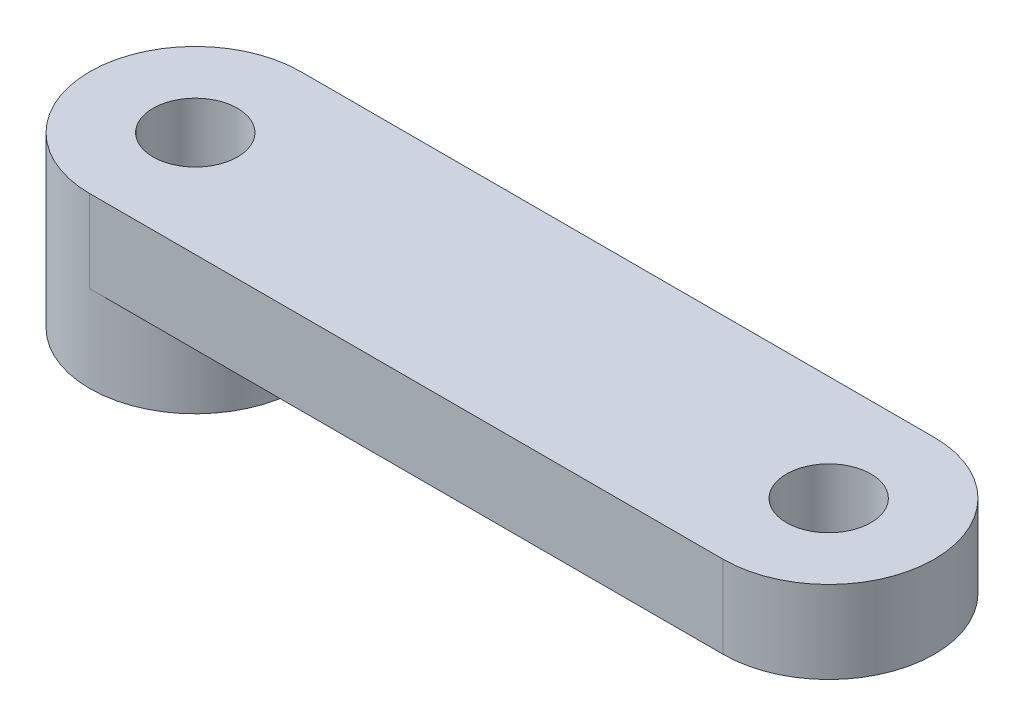
ISO-10303-21;
HEADER;
FILE_DESCRIPTION(('STEP AP214'),'2;1');
FILE_NAME('part.step','',(''),(''),'','','');
FILE_SCHEMA(('AUTOMOTIVE_DESIGN { 1 0 10303 214 1 1 1 1 }'));
ENDSEC;
DATA;
#1=APPLICATION_CONTEXT('core data for automotive mechanical design processes');
#2=APPLICATION_PROTOCOL_DEFINITION('international standard','automotive_design',2000,#1);
#3=PRODUCT_CONTEXT('',#1,'mechanical');
#4=PRODUCT('Part','Part','',(#3));
#5=PRODUCT_RELATED_PRODUCT_CATEGORY('part','',(#4));
#6=PRODUCT_DEFINITION_FORMATION('','',#4);
#7=PRODUCT_DEFINITION_CONTEXT('part definition',#1,'design');
#8=PRODUCT_DEFINITION('design','',#6,#7);
#9=PRODUCT_DEFINITION_SHAPE('','',#8);
#10=(LENGTH_UNIT() NAMED_UNIT(*) SI_UNIT(.MILLI.,.METRE.));
#11=(NAMED_UNIT(*) PLANE_ANGLE_UNIT() SI_UNIT($,.RADIAN.));
#12=(NAMED_UNIT(*) SI_UNIT($,.STERADIAN.) SOLID_ANGLE_UNIT());
#13=UNCERTAINTY_MEASURE_WITH_UNIT(LENGTH_MEASURE(1.E-05),#10,'distance_accuracy_value','');
#14=(GEOMETRIC_REPRESENTATION_CONTEXT(3) GLOBAL_UNCERTAINTY_ASSIGNED_CONTEXT((#13)) GLOBAL_UNIT_ASSIGNED_CONTEXT((#10,
#11,#12)) REPRESENTATION_CONTEXT('',''));
#15=CARTESIAN_POINT('',(0.,0.,0.));
#16=DIRECTION('',(0.,0.,1.));
#17=DIRECTION('',(1.,0.,0.));
#18=AXIS2_PLACEMENT_3D('',#15,#16,#17);
#19=CARTESIAN_POINT('',(-10.3744813820519,-3.9,37.1786968159599));
#20=DIRECTION('',(0.,-1.,0.));
#21=DIRECTION('',(0.,0.,-1.));
#22=AXIS2_PLACEMENT_3D('',#19,#20,#21);
#23=PLANE('',#22);
#24=CARTESIAN_POINT('',(19.6255186179481,-3.9,37.1786968159599));
#25=DIRECTION('',(0.,-1.,0.));
#26=DIRECTION('',(0.,0.,-1.));
#27=AXIS2_PLACEMENT_3D('',#24,#25,#26);
#28=CIRCLE('',#27,2.);
#29=CARTESIAN_POINT('',(19.6255186179481,-3.9,35.1786968159599));
#30=VERTEX_POINT('',#29);
#31=EDGE_CURVE('E150',#30,#30,#28,.T.);
#32=ORIENTED_EDGE('',*,*,#31,.F.);
#33=EDGE_LOOP('',(#32));
#34=FACE_BOUND('',#33,.T.);
#35=DIRECTION('',(-1.,0.,0.));
#36=VECTOR('',#35,1.);
#37=CARTESIAN_POINT('',(19.6255186179481,-3.9,42.1786968159599));
#38=LINE('',#37,#36);
#39=CARTESIAN_POINT('',(19.6255186179481,-3.9,42.1786968159599));
#40=VERTEX_POINT('',#39);
#41=CARTESIAN_POINT('',(-10.3744813820519,-3.9,42.1786968159599));
#42=VERTEX_POINT('',#41);
#43=EDGE_CURVE('E34',#40,#42,#38,.T.);
#44=ORIENTED_EDGE('',*,*,#43,.T.);
#45=CARTESIAN_POINT('',(-10.3744813820519,-3.9,37.1786968159599));
#46=DIRECTION('',(0.,1.,0.));
#47=DIRECTION('',(-1.,0.,0.));
#48=AXIS2_PLACEMENT_3D('',#45,#46,#47);
#49=CIRCLE('',#48,5.);
#50=CARTESIAN_POINT('',(-10.3744813820519,-3.9,32.1786968159599));
#51=VERTEX_POINT('',#50);
#52=EDGE_CURVE('E68',#42,#51,#49,.T.);
#53=ORIENTED_EDGE('',*,*,#52,.T.);
#54=DIRECTION('',(1.,0.,0.));
#55=VECTOR('',#54,1.);
#56=CARTESIAN_POINT('',(-10.3744813820519,-3.9,32.1786968159599));
#57=LINE('',#56,#55);
#58=CARTESIAN_POINT('',(19.6255186179481,-3.9,32.1786968159599));
#59=VERTEX_POINT('',#58);
#60=EDGE_CURVE('E60',#51,#59,#57,.T.);
#61=ORIENTED_EDGE('',*,*,#60,.T.);
#62=CARTESIAN_POINT('',(19.6255186179481,-3.9,37.1786968159599));
#63=DIRECTION('',(0.,-1.,0.));
#64=DIRECTION('',(-1.,0.,0.));
#65=AXIS2_PLACEMENT_3D('',#62,#63,#64);
#66=CIRCLE('',#65,5.);
#67=EDGE_CURVE('E75',#59,#40,#66,.T.);
#68=ORIENTED_EDGE('',*,*,#67,.T.);
#69=EDGE_LOOP('',(#44,#53,#61,#68));
#70=FACE_BOUND('',#69,.T.);
#71=ADVANCED_FACE('F15',(#34,#70),#23,.T.);
#72=CARTESIAN_POINT('',(-10.3744813820519,-3.9,32.1786968159599));
#73=DIRECTION('',(0.,0.,1.));
#74=DIRECTION('',(1.,0.,0.));
#75=AXIS2_PLACEMENT_3D('',#72,#73,#74);
#76=PLANE('',#75);
#77=DIRECTION('',(1.,0.,0.));
#78=VECTOR('',#77,1.);
#79=CARTESIAN_POINT('',(-10.3744813820519,0.,32.1786968159599));
#80=LINE('',#79,#78);
#81=CARTESIAN_POINT('',(-10.3744813820519,0.,32.1786968159599));
#82=VERTEX_POINT('',#81);
#83=CARTESIAN_POINT('',(19.6255186179481,0.,32.1786968159599));
#84=VERTEX_POINT('',#83);
#85=EDGE_CURVE('E84',#82,#84,#80,.T.);
#86=ORIENTED_EDGE('',*,*,#85,.T.);
#87=DIRECTION('',(0.,1.,0.));
#88=VECTOR('',#87,1.);
#89=CARTESIAN_POINT('',(19.6255186179481,-3.9,32.1786968159599));
#90=LINE('',#89,#88);
#91=EDGE_CURVE('E25',#59,#84,#90,.T.);
#92=ORIENTED_EDGE('',*,*,#91,.F.);
#93=ORIENTED_EDGE('',*,*,#60,.F.);
#94=DIRECTION('',(0.,1.,0.));
#95=VECTOR('',#94,1.);
#96=CARTESIAN_POINT('',(-10.3744813820519,-3.9,32.1786968159599));
#97=LINE('',#96,#95);
#98=EDGE_CURVE('E9',#51,#82,#97,.T.);
#99=ORIENTED_EDGE('',*,*,#98,.T.);
#100=EDGE_LOOP('',(#86,#92,#93,#99));
#101=FACE_BOUND('',#100,.T.);
#102=ADVANCED_FACE('F17',(#101),#76,.F.);
#103=CARTESIAN_POINT('',(19.6255186179481,-3.9,37.1786968159599));
#104=DIRECTION('',(0.,1.,0.));
#105=DIRECTION('',(0.,0.,1.));
#106=AXIS2_PLACEMENT_3D('',#103,#104,#105);
#107=CYLINDRICAL_SURFACE('',#106,5.);
#108=CARTESIAN_POINT('',(19.6255186179481,0.,37.1786968159599));
#109=DIRECTION('',(0.,-1.,0.));
#110=DIRECTION('',(-1.,0.,0.));
#111=AXIS2_PLACEMENT_3D('',#108,#109,#110);
#112=CIRCLE('',#111,5.);
#113=CARTESIAN_POINT('',(19.6255186179481,0.,42.1786968159599));
#114=VERTEX_POINT('',#113);
#115=EDGE_CURVE('E51',#84,#114,#112,.T.);
#116=ORIENTED_EDGE('',*,*,#115,.T.);
#117=DIRECTION('',(0.,1.,0.));
#118=VECTOR('',#117,1.);
#119=CARTESIAN_POINT('',(19.6255186179481,-3.9,42.1786968159599));
#120=LINE('',#119,#118);
#121=EDGE_CURVE('E104',#40,#114,#120,.T.);
#122=ORIENTED_EDGE('',*,*,#121,.F.);
#123=ORIENTED_EDGE('',*,*,#67,.F.);
#124=ORIENTED_EDGE('',*,*,#91,.T.);
#125=EDGE_LOOP('',(#116,#122,#123,#124));
#126=FACE_BOUND('',#125,.T.);
#127=ADVANCED_FACE('F114',(#126),#107,.T.);
#128=CARTESIAN_POINT('',(19.6255186179481,-3.9,42.1786968159599));
#129=DIRECTION('',(0.,0.,-1.));
#130=DIRECTION('',(-1.,0.,0.));
#131=AXIS2_PLACEMENT_3D('',#128,#129,#130);
#132=PLANE('',#131);
#133=DIRECTION('',(-1.,0.,0.));
#134=VECTOR('',#133,1.);
#135=CARTESIAN_POINT('',(19.6255186179481,0.,42.1786968159599));
#136=LINE('',#135,#134);
#137=CARTESIAN_POINT('',(-10.3744813820519,0.,42.1786968159599));
#138=VERTEX_POINT('',#137);
#139=EDGE_CURVE('E56',#114,#138,#136,.T.);
#140=ORIENTED_EDGE('',*,*,#139,.T.);
#141=DIRECTION('',(0.,1.,0.));
#142=VECTOR('',#141,1.);
#143=CARTESIAN_POINT('',(-10.3744813820519,-3.9,42.1786968159599));
#144=LINE('',#143,#142);
#145=EDGE_CURVE('E101',#42,#138,#144,.T.);
#146=ORIENTED_EDGE('',*,*,#145,.F.);
#147=ORIENTED_EDGE('',*,*,#43,.F.);
#148=ORIENTED_EDGE('',*,*,#121,.T.);
#149=EDGE_LOOP('',(#140,#146,#147,#148));
#150=FACE_BOUND('',#149,.T.);
#151=ADVANCED_FACE('F115',(#150),#132,.F.);
#152=CARTESIAN_POINT('',(-10.3744813820519,-3.9,37.1786968159599));
#153=DIRECTION('',(0.,1.,0.));
#154=DIRECTION('',(0.,0.,1.));
#155=AXIS2_PLACEMENT_3D('',#152,#153,#154);
#156=CYLINDRICAL_SURFACE('',#155,5.);
#157=CARTESIAN_POINT('',(-10.3744813820519,0.,37.1786968159599));
#158=DIRECTION('',(0.,-1.,0.));
#159=DIRECTION('',(1.,0.,0.));
#160=AXIS2_PLACEMENT_3D('',#157,#158,#159);
#161=CIRCLE('',#160,5.);
#162=EDGE_CURVE('E70',#138,#82,#161,.T.);
#163=ORIENTED_EDGE('',*,*,#162,.T.);
#164=ORIENTED_EDGE('',*,*,#98,.F.);
#165=ORIENTED_EDGE('',*,*,#52,.F.);
#166=ORIENTED_EDGE('',*,*,#145,.T.);
#167=EDGE_LOOP('',(#163,#164,#165,#166));
#168=FACE_BOUND('',#167,.T.);
#169=CARTESIAN_POINT('',(-10.3744813820519,-8.,37.1786968159599));
#170=DIRECTION('',(0.,1.,0.));
#171=DIRECTION('',(-1.,0.,0.));
#172=AXIS2_PLACEMENT_3D('',#169,#170,#171);
#173=CIRCLE('',#172,5.);
#174=CARTESIAN_POINT('',(-15.3744813820519,-8.,37.1786968159599));
#175=VERTEX_POINT('',#174);
#176=EDGE_CURVE('E78',#175,#175,#173,.T.);
#177=ORIENTED_EDGE('',*,*,#176,.T.);
#178=EDGE_LOOP('',(#177));
#179=FACE_BOUND('',#178,.T.);
#180=ADVANCED_FACE('F66',(#168,#179),#156,.T.);
#181=CARTESIAN_POINT('',(-10.3744813820519,0.,37.1786968159599));
#182=DIRECTION('',(0.,-1.,0.));
#183=DIRECTION('',(0.,0.,-1.));
#184=AXIS2_PLACEMENT_3D('',#181,#182,#183);
#185=PLANE('',#184);
#186=CARTESIAN_POINT('',(19.6255186179481,0.,37.1786968159599));
#187=DIRECTION('',(0.,-1.,0.));
#188=DIRECTION('',(0.,0.,1.));
#189=AXIS2_PLACEMENT_3D('',#186,#187,#188);
#190=CIRCLE('',#189,2.);
#191=CARTESIAN_POINT('',(19.6255186179481,0.,39.1786968159599));
#192=VERTEX_POINT('',#191);
#193=EDGE_CURVE('E146',#192,#192,#190,.T.);
#194=ORIENTED_EDGE('',*,*,#193,.T.);
#195=EDGE_LOOP('',(#194));
#196=FACE_BOUND('',#195,.T.);
#197=CARTESIAN_POINT('',(-10.3744813820519,0.,37.1786968159599));
#198=DIRECTION('',(0.,-1.,0.));
#199=DIRECTION('',(0.,0.,1.));
#200=AXIS2_PLACEMENT_3D('',#197,#198,#199);
#201=CIRCLE('',#200,2.);
#202=CARTESIAN_POINT('',(-10.3744813820519,0.,39.1786968159599));
#203=VERTEX_POINT('',#202);
#204=EDGE_CURVE('E87',#203,#203,#201,.T.);
#205=ORIENTED_EDGE('',*,*,#204,.T.);
#206=EDGE_LOOP('',(#205));
#207=FACE_BOUND('',#206,.T.);
#208=ORIENTED_EDGE('',*,*,#85,.F.);
#209=ORIENTED_EDGE('',*,*,#162,.F.);
#210=ORIENTED_EDGE('',*,*,#139,.F.);
#211=ORIENTED_EDGE('',*,*,#115,.F.);
#212=EDGE_LOOP('',(#208,#209,#210,#211));
#213=FACE_BOUND('',#212,.T.);
#214=ADVANCED_FACE('F123',(#196,#207,#213),#185,.F.);
#215=CARTESIAN_POINT('',(-10.3744813820519,-8.,37.1786968159599));
#216=DIRECTION('',(0.,1.,0.));
#217=DIRECTION('',(0.,0.,1.));
#218=AXIS2_PLACEMENT_3D('',#215,#216,#217);
#219=PLANE('',#218);
#220=CARTESIAN_POINT('',(-10.3744813820519,-8.,37.1786968159599));
#221=DIRECTION('',(0.,1.,0.));
#222=DIRECTION('',(0.,0.,1.));
#223=AXIS2_PLACEMENT_3D('',#220,#221,#222);
#224=CIRCLE('',#223,2.);
#225=CARTESIAN_POINT('',(-10.3744813820519,-8.,39.1786968159599));
#226=VERTEX_POINT('',#225);
#227=EDGE_CURVE('E19',#226,#226,#224,.T.);
#228=ORIENTED_EDGE('',*,*,#227,.T.);
#229=EDGE_LOOP('',(#228));
#230=FACE_BOUND('',#229,.T.);
#231=ORIENTED_EDGE('',*,*,#176,.F.);
#232=EDGE_LOOP('',(#231));
#233=FACE_BOUND('',#232,.T.);
#234=ADVANCED_FACE('F134',(#230,#233),#219,.F.);
#235=CARTESIAN_POINT('',(-10.3744813820519,0.,37.1786968159599));
#236=DIRECTION('',(0.,-1.,0.));
#237=DIRECTION('',(0.,0.,1.));
#238=AXIS2_PLACEMENT_3D('',#235,#236,#237);
#239=CYLINDRICAL_SURFACE('',#238,2.);
#240=ORIENTED_EDGE('',*,*,#204,.F.);
#241=EDGE_LOOP('',(#240));
#242=FACE_BOUND('',#241,.T.);
#243=ORIENTED_EDGE('',*,*,#227,.F.);
#244=EDGE_LOOP('',(#243));
#245=FACE_BOUND('',#244,.T.);
#246=ADVANCED_FACE('F141',(#242,#245),#239,.F.);
#247=CARTESIAN_POINT('',(19.6255186179481,0.,37.1786968159599));
#248=DIRECTION('',(0.,-1.,0.));
#249=DIRECTION('',(0.,0.,1.));
#250=AXIS2_PLACEMENT_3D('',#247,#248,#249);
#251=CYLINDRICAL_SURFACE('',#250,2.);
#252=ORIENTED_EDGE('',*,*,#31,.T.);
#253=EDGE_LOOP('',(#252));
#254=FACE_BOUND('',#253,.T.);
#255=ORIENTED_EDGE('',*,*,#193,.F.);
#256=EDGE_LOOP('',(#255));
#257=FACE_BOUND('',#256,.T.);
#258=ADVANCED_FACE('F155',(#254,#257),#251,.F.);
#259=CLOSED_SHELL('',(#71,#102,#127,#151,#180,#214,#234,#246,#258));
#260=MANIFOLD_SOLID_BREP('B1',#259);
#261=ADVANCED_BREP_SHAPE_REPRESENTATION('',(#18,#260),#14);
#262=SHAPE_DEFINITION_REPRESENTATION(#9,#261);
ENDSEC;
END-ISO-10303-21;
